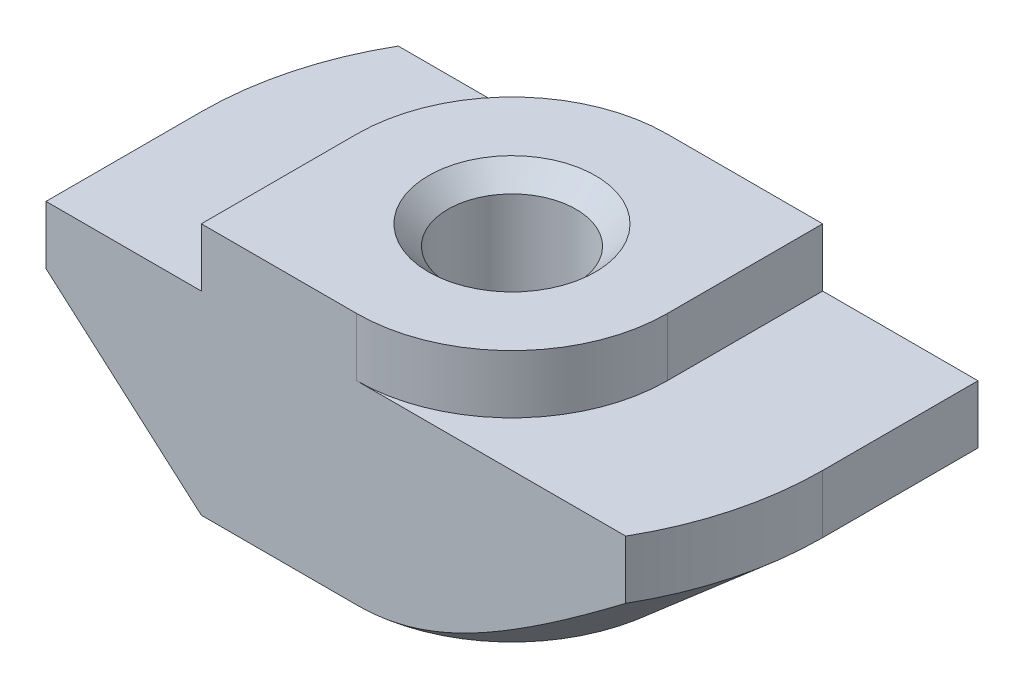
ISO-10303-21;
HEADER;
FILE_DESCRIPTION(('STEP AP214'),'2;1');
FILE_NAME('part.step','',(''),(''),'','','');
FILE_SCHEMA(('AUTOMOTIVE_DESIGN { 1 0 10303 214 1 1 1 1 }'));
ENDSEC;
DATA;
#1=APPLICATION_CONTEXT('core data for automotive mechanical design processes');
#2=APPLICATION_PROTOCOL_DEFINITION('international standard','automotive_design',2000,#1);
#3=PRODUCT_CONTEXT('',#1,'mechanical');
#4=PRODUCT('Part','Part','',(#3));
#5=PRODUCT_RELATED_PRODUCT_CATEGORY('part','',(#4));
#6=PRODUCT_DEFINITION_FORMATION('','',#4);
#7=PRODUCT_DEFINITION_CONTEXT('part definition',#1,'design');
#8=PRODUCT_DEFINITION('design','',#6,#7);
#9=PRODUCT_DEFINITION_SHAPE('','',#8);
#10=(LENGTH_UNIT() NAMED_UNIT(*) SI_UNIT(.MILLI.,.METRE.));
#11=(NAMED_UNIT(*) PLANE_ANGLE_UNIT() SI_UNIT($,.RADIAN.));
#12=(NAMED_UNIT(*) SI_UNIT($,.STERADIAN.) SOLID_ANGLE_UNIT());
#13=UNCERTAINTY_MEASURE_WITH_UNIT(LENGTH_MEASURE(1.E-05),#10,'distance_accuracy_value','');
#14=(GEOMETRIC_REPRESENTATION_CONTEXT(3) GLOBAL_UNCERTAINTY_ASSIGNED_CONTEXT((#13)) GLOBAL_UNIT_ASSIGNED_CONTEXT((#10,
#11,#12)) REPRESENTATION_CONTEXT('',''));
#15=CARTESIAN_POINT('',(0.,0.,0.));
#16=DIRECTION('',(0.,0.,1.));
#17=DIRECTION('',(1.,0.,0.));
#18=AXIS2_PLACEMENT_3D('',#15,#16,#17);
#19=CARTESIAN_POINT('',(-8.,-1.5,4.));
#20=DIRECTION('',(1.,0.,0.));
#21=DIRECTION('',(0.,0.,-1.));
#22=AXIS2_PLACEMENT_3D('',#19,#20,#21);
#23=PLANE('',#22);
#24=DIRECTION('',(0.,0.,-1.));
#25=VECTOR('',#24,1.);
#26=CARTESIAN_POINT('',(-8.,-3.,4.));
#27=LINE('',#26,#25);
#28=CARTESIAN_POINT('',(-8.,-3.,4.));
#29=VERTEX_POINT('',#28);
#30=CARTESIAN_POINT('',(-8.,-3.,0.));
#31=VERTEX_POINT('',#30);
#32=EDGE_CURVE('E316',#29,#31,#27,.T.);
#33=ORIENTED_EDGE('',*,*,#32,.F.);
#34=DIRECTION('',(0.,-1.,0.));
#35=VECTOR('',#34,1.);
#36=CARTESIAN_POINT('',(-8.,-1.5,4.));
#37=LINE('',#36,#35);
#38=CARTESIAN_POINT('',(-8.,-1.5,4.));
#39=VERTEX_POINT('',#38);
#40=EDGE_CURVE('E162',#39,#29,#37,.T.);
#41=ORIENTED_EDGE('',*,*,#40,.F.);
#42=DIRECTION('',(0.,0.,-1.));
#43=VECTOR('',#42,1.);
#44=CARTESIAN_POINT('',(-8.,-1.5,4.));
#45=LINE('',#44,#43);
#46=CARTESIAN_POINT('',(-8.,-1.5,0.));
#47=VERTEX_POINT('',#46);
#48=EDGE_CURVE('E44',#39,#47,#45,.T.);
#49=ORIENTED_EDGE('',*,*,#48,.T.);
#50=DIRECTION('',(0.,1.,0.));
#51=VECTOR('',#50,1.);
#52=CARTESIAN_POINT('',(-8.,-6.5,0.));
#53=LINE('',#52,#51);
#54=EDGE_CURVE('E208',#31,#47,#53,.T.);
#55=ORIENTED_EDGE('',*,*,#54,.F.);
#56=EDGE_LOOP('',(#33,#41,#49,#55));
#57=FACE_BOUND('',#56,.T.);
#58=ADVANCED_FACE('F36',(#57),#23,.F.);
#59=CARTESIAN_POINT('',(-8.,-6.5,4.));
#60=DIRECTION('',(0.,1.,0.));
#61=DIRECTION('',(0.,0.,1.));
#62=AXIS2_PLACEMENT_3D('',#59,#60,#61);
#63=PLANE('',#62);
#64=CARTESIAN_POINT('',(0.,-6.5,0.));
#65=DIRECTION('',(0.,1.,0.));
#66=DIRECTION('',(0.,0.,1.));
#67=AXIS2_PLACEMENT_3D('',#64,#65,#66);
#68=CIRCLE('',#67,2.15);
#69=CARTESIAN_POINT('',(0.,-6.5,2.15));
#70=VERTEX_POINT('',#69);
#71=EDGE_CURVE('E257',#70,#70,#68,.T.);
#72=ORIENTED_EDGE('',*,*,#71,.T.);
#73=EDGE_LOOP('',(#72));
#74=FACE_BOUND('',#73,.T.);
#75=DIRECTION('',(1.,0.,0.));
#76=VECTOR('',#75,1.);
#77=CARTESIAN_POINT('',(-8.,-6.5,4.));
#78=LINE('',#77,#76);
#79=CARTESIAN_POINT('',(-4.,-6.5,4.));
#80=VERTEX_POINT('',#79);
#81=CARTESIAN_POINT('',(0.,-6.5,4.));
#82=VERTEX_POINT('',#81);
#83=EDGE_CURVE('E160',#80,#82,#78,.T.);
#84=ORIENTED_EDGE('',*,*,#83,.F.);
#85=DIRECTION('',(0.,0.,-1.));
#86=VECTOR('',#85,1.);
#87=CARTESIAN_POINT('',(-4.,-6.5,4.));
#88=LINE('',#87,#86);
#89=CARTESIAN_POINT('',(-4.,-6.5,0.));
#90=VERTEX_POINT('',#89);
#91=EDGE_CURVE('E145',#80,#90,#88,.T.);
#92=ORIENTED_EDGE('',*,*,#91,.T.);
#93=CARTESIAN_POINT('',(0.,-6.5,0.));
#94=DIRECTION('',(0.,-1.,0.));
#95=DIRECTION('',(-1.,0.,0.));
#96=AXIS2_PLACEMENT_3D('',#93,#94,#95);
#97=CIRCLE('',#96,4.);
#98=CARTESIAN_POINT('',(0.,-6.5,-4.));
#99=VERTEX_POINT('',#98);
#100=EDGE_CURVE('E317',#90,#99,#97,.T.);
#101=ORIENTED_EDGE('',*,*,#100,.T.);
#102=DIRECTION('',(1.,0.,0.));
#103=VECTOR('',#102,1.);
#104=CARTESIAN_POINT('',(-8.,-6.5,-4.));
#105=LINE('',#104,#103);
#106=CARTESIAN_POINT('',(4.,-6.5,-4.));
#107=VERTEX_POINT('',#106);
#108=EDGE_CURVE('E180',#99,#107,#105,.T.);
#109=ORIENTED_EDGE('',*,*,#108,.T.);
#110=DIRECTION('',(0.,0.,1.));
#111=VECTOR('',#110,1.);
#112=CARTESIAN_POINT('',(4.,-6.5,-8.));
#113=LINE('',#112,#111);
#114=CARTESIAN_POINT('',(4.,-6.5,0.));
#115=VERTEX_POINT('',#114);
#116=EDGE_CURVE('E51',#107,#115,#113,.T.);
#117=ORIENTED_EDGE('',*,*,#116,.T.);
#118=CARTESIAN_POINT('',(0.,-6.5,0.));
#119=DIRECTION('',(0.,-1.,0.));
#120=DIRECTION('',(1.,0.,0.));
#121=AXIS2_PLACEMENT_3D('',#118,#119,#120);
#122=CIRCLE('',#121,4.);
#123=EDGE_CURVE('E166',#115,#82,#122,.T.);
#124=ORIENTED_EDGE('',*,*,#123,.T.);
#125=EDGE_LOOP('',(#84,#92,#101,#109,#117,#124));
#126=FACE_BOUND('',#125,.T.);
#127=ADVANCED_FACE('F165',(#74,#126),#63,.F.);
#128=CARTESIAN_POINT('',(8.,-1.5,4.));
#129=DIRECTION('',(-1.,0.,0.));
#130=DIRECTION('',(0.,0.,1.));
#131=AXIS2_PLACEMENT_3D('',#128,#129,#130);
#132=PLANE('',#131);
#133=DIRECTION('',(0.,0.,1.));
#134=VECTOR('',#133,1.);
#135=CARTESIAN_POINT('',(8.,-3.,-8.));
#136=LINE('',#135,#134);
#137=CARTESIAN_POINT('',(8.,-3.,-4.));
#138=VERTEX_POINT('',#137);
#139=CARTESIAN_POINT('',(8.,-3.,0.));
#140=VERTEX_POINT('',#139);
#141=EDGE_CURVE('E304',#138,#140,#136,.T.);
#142=ORIENTED_EDGE('',*,*,#141,.F.);
#143=DIRECTION('',(0.,1.,0.));
#144=VECTOR('',#143,1.);
#145=CARTESIAN_POINT('',(8.,-1.5,-4.));
#146=LINE('',#145,#144);
#147=CARTESIAN_POINT('',(8.,-1.5,-4.));
#148=VERTEX_POINT('',#147);
#149=EDGE_CURVE('E184',#138,#148,#146,.T.);
#150=ORIENTED_EDGE('',*,*,#149,.T.);
#151=DIRECTION('',(0.,0.,-1.));
#152=VECTOR('',#151,1.);
#153=CARTESIAN_POINT('',(8.,-1.5,4.));
#154=LINE('',#153,#152);
#155=CARTESIAN_POINT('',(8.,-1.5,0.));
#156=VERTEX_POINT('',#155);
#157=EDGE_CURVE('E202',#156,#148,#154,.T.);
#158=ORIENTED_EDGE('',*,*,#157,.F.);
#159=DIRECTION('',(0.,1.,0.));
#160=VECTOR('',#159,1.);
#161=CARTESIAN_POINT('',(8.,-6.5,0.));
#162=LINE('',#161,#160);
#163=EDGE_CURVE('E219',#140,#156,#162,.T.);
#164=ORIENTED_EDGE('',*,*,#163,.F.);
#165=EDGE_LOOP('',(#142,#150,#158,#164));
#166=FACE_BOUND('',#165,.T.);
#167=ADVANCED_FACE('F303',(#166),#132,.F.);
#168=CARTESIAN_POINT('',(0.,0.,4.));
#169=DIRECTION('',(0.,0.,-1.));
#170=DIRECTION('',(-1.,0.,0.));
#171=AXIS2_PLACEMENT_3D('',#168,#169,#170);
#172=PLANE('',#171);
#173=DIRECTION('',(-0.752576694706878,0.658504607868518,0.));
#174=VECTOR('',#173,1.);
#175=CARTESIAN_POINT('',(-4.,-6.5,4.));
#176=LINE('',#175,#174);
#177=EDGE_CURVE('E148',#80,#29,#176,.T.);
#178=ORIENTED_EDGE('',*,*,#177,.F.);
#179=ORIENTED_EDGE('',*,*,#83,.T.);
#180=CARTESIAN_POINT('',(14.6904905784055,3.32215914737832,4.));
#181=CARTESIAN_POINT('',(14.3847340887088,3.06403182750837,4.));
#182=CARTESIAN_POINT('',(14.0787139356754,2.80621594721695,4.));
#183=CARTESIAN_POINT('',(13.4660102927614,2.29136853816874,4.));
#184=CARTESIAN_POINT('',(13.1593267973511,2.03433701599371,4.));
#185=CARTESIAN_POINT('',(12.5450720332835,1.52114597216813,4.));
#186=CARTESIAN_POINT('',(12.2375005226594,1.26498673998448,4.));
#187=CARTESIAN_POINT('',(11.621379785589,0.753848346635908,4.));
#188=CARTESIAN_POINT('',(11.3128305625947,0.498869181312189,4.));
#189=CARTESIAN_POINT('',(10.7002145011881,-0.00491682645367106,4.));
#190=CARTESIAN_POINT('',(10.3961699625989,-0.253750767290044,4.));
#191=CARTESIAN_POINT('',(9.78659827767615,-0.749595514973884,4.));
#192=CARTESIAN_POINT('',(9.48107113722175,-0.996606329041067,4.));
#193=CARTESIAN_POINT('',(8.86814910234505,-1.48822154847088,4.));
#194=CARTESIAN_POINT('',(8.56075445261905,-1.7328262585509,4.));
#195=CARTESIAN_POINT('',(7.94347197423434,-2.21886531838598,4.));
#196=CARTESIAN_POINT('',(7.63358419509566,-2.46029973086189,4.));
#197=CARTESIAN_POINT('',(7.08115132126321,-2.88450105938665,4.));
#198=CARTESIAN_POINT('',(6.83928285358191,-3.06814795081988,4.));
#199=CARTESIAN_POINT('',(6.35294664237881,-3.43201927580775,4.));
#200=CARTESIAN_POINT('',(6.10847869152532,-3.61224343312641,4.));
#201=CARTESIAN_POINT('',(5.61348157153568,-3.97001904061898,4.));
#202=CARTESIAN_POINT('',(5.36291531280204,-4.14751931475903,4.));
#203=CARTESIAN_POINT('',(4.85727365006101,-4.49592911962344,4.));
#204=CARTESIAN_POINT('',(4.60219916319015,-4.66683996887094,4.));
#205=CARTESIAN_POINT('',(4.2130071322017,-4.91734041501033,4.));
#206=CARTESIAN_POINT('',(4.08116535064602,-5.00046374434322,4.));
#207=CARTESIAN_POINT('',(3.81562875478638,-5.16368942812443,4.));
#208=CARTESIAN_POINT('',(3.68193405117562,-5.24379196197976,4.));
#209=CARTESIAN_POINT('',(3.41220147814096,-5.40038499680941,4.));
#210=CARTESIAN_POINT('',(3.27616075326498,-5.47687059912128,4.));
#211=CARTESIAN_POINT('',(3.00156225820197,-5.62520082854102,4.));
#212=CARTESIAN_POINT('',(2.86300454546661,-5.69704556140923,4.));
#213=CARTESIAN_POINT('',(2.5849954677744,-5.83393518990307,4.));
#214=CARTESIAN_POINT('',(2.44558485527697,-5.89906227835382,4.));
#215=CARTESIAN_POINT('',(2.16361562976938,-6.02223140662004,4.));
#216=CARTESIAN_POINT('',(2.02105656760955,-6.08027242774449,4.));
#217=CARTESIAN_POINT('',(1.7329549007792,-6.18735094349871,4.));
#218=CARTESIAN_POINT('',(1.58742049089665,-6.2364102179662,4.));
#219=CARTESIAN_POINT('',(1.29316207972955,-6.32363216278026,4.));
#220=CARTESIAN_POINT('',(1.1444398948231,-6.36180086992272,4.));
#221=CARTESIAN_POINT('',(0.839100640998917,-6.42624492204711,4.));
#222=CARTESIAN_POINT('',(0.682386957719906,-6.45207249805466,4.));
#223=CARTESIAN_POINT('',(0.367144369417336,-6.48794533602483,4.));
#224=CARTESIAN_POINT('',(0.208615728897641,-6.49799286893765,4.));
#225=CARTESIAN_POINT('',(-0.108539722018433,-6.50145944673209,4.));
#226=CARTESIAN_POINT('',(-0.267166425139258,-6.49488795542754,4.));
#227=CARTESIAN_POINT('',(-0.582932728201337,-6.46570204746688,4.));
#228=CARTESIAN_POINT('',(-0.740071943547874,-6.44308359075197,4.));
#229=CARTESIAN_POINT('',(-1.09152696533888,-6.37587755691426,4.));
#230=CARTESIAN_POINT('',(-1.28504118066978,-6.32714329543957,4.));
#231=CARTESIAN_POINT('',(-1.66656634751073,-6.21161586114347,4.));
#232=CARTESIAN_POINT('',(-1.85457361936942,-6.14481090567952,4.));
#233=CARTESIAN_POINT('',(-2.22785278502951,-5.99643229439673,4.));
#234=CARTESIAN_POINT('',(-2.41304095011,-5.91465153583585,4.));
#235=CARTESIAN_POINT('',(-2.77832077795005,-5.74066303773618,4.));
#236=CARTESIAN_POINT('',(-2.95841376958414,-5.64845804888058,4.));
#237=CARTESIAN_POINT('',(-3.34961919306917,-5.43725005686976,4.));
#238=CARTESIAN_POINT('',(-3.55981165080308,-5.31655620274668,4.));
#239=CARTESIAN_POINT('',(-3.97543991863338,-5.06719713259556,4.));
#240=CARTESIAN_POINT('',(-4.18087442666426,-4.93852976912504,4.));
#241=CARTESIAN_POINT('',(-4.5882400284195,-4.67520296890076,4.));
#242=CARTESIAN_POINT('',(-4.79016601988849,-4.54053567979022,4.));
#243=CARTESIAN_POINT('',(-5.19103912814155,-4.26683396442206,4.));
#244=CARTESIAN_POINT('',(-5.38998608598997,-4.12779930637635,4.));
#245=CARTESIAN_POINT('',(-5.7725203673202,-3.8556281179886,4.));
#246=CARTESIAN_POINT('',(-5.95625882060498,-3.72270335637143,4.));
#247=CARTESIAN_POINT('',(-6.32204531106766,-3.45453802790882,4.));
#248=CARTESIAN_POINT('',(-6.50409328688208,-3.31929737750067,4.));
#249=CARTESIAN_POINT('',(-6.86616256077309,-3.04743487184612,4.));
#250=CARTESIAN_POINT('',(-7.04618870734579,-2.91081946202426,4.));
#251=CARTESIAN_POINT('',(-7.4050622812191,-2.63608068651936,4.));
#252=CARTESIAN_POINT('',(-7.58390981061062,-2.49795745427084,4.));
#253=CARTESIAN_POINT('',(-7.76228734813001,-2.35923541653878,4.));
#254=B_SPLINE_CURVE_WITH_KNOTS('',3,(#180,#181,#182,#183,#184,#185,#186,#187,#188,#189,#190,
#191,#192,#193,#194,#195,#196,#197,#198,#199,#200,#201,#202,#203,#204,#205,#206,#207,#208,#209,
#210,#211,#212,#213,#214,#215,#216,#217,#218,#219,#220,#221,#222,#223,#224,#225,#226,#227,#228,
#229,#230,#231,#232,#233,#234,#235,#236,#237,#238,#239,#240,#241,#242,#243,#244,#245,#246,#247,
#248,#249,#250,#251,#252,#253),.UNSPECIFIED.,.F.,.F.,(4,2,2,2,2,2,2,2,2,2,2,2,2,2,2,2,2,2,2,2,2,
2,2,2,2,2,2,2,2,2,2,2,2,2,2,2,4),(0.,1.20043834755379,2.40088674077275,3.60170079974658,
4.8025106235708,5.98117091859529,7.15982654353094,8.33833092623221,9.51681195828205,
10.4278547957749,11.3389708502966,12.2601049438173,13.1810537544666,13.6485968730272,
14.1161121800276,14.5842435321965,15.052364212398,15.5138255838833,15.975353217003,
16.4357464236847,16.8958839298801,17.3716429767656,17.8473335495587,18.3227532981969,
18.798292783222,19.3957954910143,19.9936887317903,20.6005786392438,21.2073087763798,
21.9341934237486,22.6612746952789,23.3893372114805,24.1174384334345,24.7977544137816,
25.4780949934672,26.1560676910982,26.8339808703156),.UNSPECIFIED.);
#255=CARTESIAN_POINT('',(6.92820323027551,-3.,4.));
#256=VERTEX_POINT('',#255);
#257=EDGE_CURVE('E321',#256,#82,#254,.T.);
#258=ORIENTED_EDGE('',*,*,#257,.F.);
#259=DIRECTION('',(0.,1.,0.));
#260=VECTOR('',#259,1.);
#261=CARTESIAN_POINT('',(6.92820323027551,-6.5,4.));
#262=LINE('',#261,#260);
#263=CARTESIAN_POINT('',(6.92820323027551,-1.5,4.));
#264=VERTEX_POINT('',#263);
#265=EDGE_CURVE('E222',#256,#264,#262,.T.);
#266=ORIENTED_EDGE('',*,*,#265,.T.);
#267=DIRECTION('',(-1.,0.,0.));
#268=VECTOR('',#267,1.);
#269=CARTESIAN_POINT('',(4.,-1.5,4.));
#270=LINE('',#269,#268);
#271=CARTESIAN_POINT('',(0.,-1.5,4.));
#272=VERTEX_POINT('',#271);
#273=EDGE_CURVE('E167',#264,#272,#270,.T.);
#274=ORIENTED_EDGE('',*,*,#273,.T.);
#275=DIRECTION('',(0.,1.,0.));
#276=VECTOR('',#275,1.);
#277=CARTESIAN_POINT('',(0.,-7.15685424949238,4.));
#278=LINE('',#277,#276);
#279=CARTESIAN_POINT('',(0.,0.,4.));
#280=VERTEX_POINT('',#279);
#281=EDGE_CURVE('E245',#272,#280,#278,.T.);
#282=ORIENTED_EDGE('',*,*,#281,.T.);
#283=DIRECTION('',(-1.,0.,0.));
#284=VECTOR('',#283,1.);
#285=CARTESIAN_POINT('',(4.,0.,4.));
#286=LINE('',#285,#284);
#287=CARTESIAN_POINT('',(-4.,0.,4.));
#288=VERTEX_POINT('',#287);
#289=EDGE_CURVE('E169',#280,#288,#286,.T.);
#290=ORIENTED_EDGE('',*,*,#289,.T.);
#291=DIRECTION('',(0.,-1.,0.));
#292=VECTOR('',#291,1.);
#293=CARTESIAN_POINT('',(-4.,0.,4.));
#294=LINE('',#293,#292);
#295=CARTESIAN_POINT('',(-4.,-1.5,4.));
#296=VERTEX_POINT('',#295);
#297=EDGE_CURVE('E195',#288,#296,#294,.T.);
#298=ORIENTED_EDGE('',*,*,#297,.T.);
#299=DIRECTION('',(-1.,0.,0.));
#300=VECTOR('',#299,1.);
#301=CARTESIAN_POINT('',(-4.,-1.5,4.));
#302=LINE('',#301,#300);
#303=EDGE_CURVE('E171',#296,#39,#302,.T.);
#304=ORIENTED_EDGE('',*,*,#303,.T.);
#305=ORIENTED_EDGE('',*,*,#40,.T.);
#306=EDGE_LOOP('',(#178,#179,#258,#266,#274,#282,#290,#298,#304,#305));
#307=FACE_BOUND('',#306,.T.);
#308=ADVANCED_FACE('F158',(#307),#172,.F.);
#309=CARTESIAN_POINT('',(0.,0.,-4.));
#310=DIRECTION('',(0.,0.,-1.));
#311=DIRECTION('',(-1.,0.,0.));
#312=AXIS2_PLACEMENT_3D('',#309,#310,#311);
#313=PLANE('',#312);
#314=ORIENTED_EDGE('',*,*,#108,.F.);
#315=CARTESIAN_POINT('',(7.76228734813001,-2.35923541653878,-4.));
#316=CARTESIAN_POINT('',(7.63797879352638,-2.45592015293055,-4.));
#317=CARTESIAN_POINT('',(7.51343705696513,-2.55230486304676,-4.));
#318=CARTESIAN_POINT('',(7.26381762684636,-2.74438155235194,-4.));
#319=CARTESIAN_POINT('',(7.13873992508832,-2.84007352088096,-4.));
#320=CARTESIAN_POINT('',(6.76245796143779,-3.12607801429787,-4.));
#321=CARTESIAN_POINT('',(6.51034969039623,-3.3152061228012,-4.));
#322=CARTESIAN_POINT('',(5.99410259404109,-3.69579382335301,-4.));
#323=CARTESIAN_POINT('',(5.72985208763481,-3.88710225926351,-4.));
#324=CARTESIAN_POINT('',(5.19695761667315,-4.26334385378289,-4.));
#325=CARTESIAN_POINT('',(4.92831530480901,-4.44827933273934,-4.));
#326=CARTESIAN_POINT('',(4.52051944159743,-4.71893396527764,-4.));
#327=CARTESIAN_POINT('',(4.38365763859022,-4.80810405751299,-4.));
#328=CARTESIAN_POINT('',(4.10812140998681,-4.98359259792687,-4.));
#329=CARTESIAN_POINT('',(3.96944707174393,-5.06991118282885,-4.));
#330=CARTESIAN_POINT('',(3.68976495223787,-5.23915159478084,-4.));
#331=CARTESIAN_POINT('',(3.5487541633338,-5.32206847356048,-4.));
#332=CARTESIAN_POINT('',(3.26422692934428,-5.48348784331378,-4.));
#333=CARTESIAN_POINT('',(3.12071056146737,-5.56199046999753,-4.));
#334=CARTESIAN_POINT('',(2.83282374140378,-5.71234353123719,-4.));
#335=CARTESIAN_POINT('',(2.68849544072785,-5.78427356099484,-4.));
#336=CARTESIAN_POINT('',(2.39663673815625,-5.92127244284365,-4.));
#337=CARTESIAN_POINT('',(2.24910576947912,-5.98634006834896,-4.));
#338=CARTESIAN_POINT('',(1.80183158618905,-6.16822752509159,-4.));
#339=CARTESIAN_POINT('',(1.49640789539285,-6.27228099552519,-4.));
#340=CARTESIAN_POINT('',(1.05233061563864,-6.38260096239082,-4.));
#341=CARTESIAN_POINT('',(0.919027463250036,-6.41066102119685,-4.));
#342=CARTESIAN_POINT('',(0.650539921788468,-6.45588615630252,-4.));
#343=CARTESIAN_POINT('',(0.51535553964587,-6.47305127272778,-4.));
#344=CARTESIAN_POINT('',(0.244416454871644,-6.49545105484671,-4.));
#345=CARTESIAN_POINT('',(0.108664879322551,-6.50072304133224,-4.));
#346=CARTESIAN_POINT('',(-0.162768146645618,-6.49911688124239,-4.));
#347=CARTESIAN_POINT('',(-0.298449596114371,-6.49223857411636,-4.));
#348=CARTESIAN_POINT('',(-0.568122439673079,-6.46681378287136,-4.));
#349=CARTESIAN_POINT('',(-0.70211852516428,-6.44831614238918,-4.));
#350=CARTESIAN_POINT('',(-0.968201604754999,-6.40073495061865,-4.));
#351=CARTESIAN_POINT('',(-1.1002884026748,-6.37165031944127,-4.));
#352=CARTESIAN_POINT('',(-1.36269157636567,-6.30410993308005,-4.));
#353=CARTESIAN_POINT('',(-1.49299633565771,-6.2656096419317,-4.));
#354=CARTESIAN_POINT('',(-1.75097360755362,-6.18078638919448,-4.));
#355=CARTESIAN_POINT('',(-1.87864668497093,-6.13446512618272,-4.));
#356=CARTESIAN_POINT('',(-2.13650460655844,-6.03336012265943,-4.));
#357=CARTESIAN_POINT('',(-2.26658470397074,-5.97831141807566,-4.));
#358=CARTESIAN_POINT('',(-2.52419349397128,-5.86250450113516,-4.));
#359=CARTESIAN_POINT('',(-2.65172159663741,-5.80174498673762,-4.));
#360=CARTESIAN_POINT('',(-2.90458369699372,-5.67553363858828,-4.));
#361=CARTESIAN_POINT('',(-3.02991533088425,-5.61007709467075,-4.));
#362=CARTESIAN_POINT('',(-3.27853105159641,-5.47537344560646,-4.));
#363=CARTESIAN_POINT('',(-3.40181492074635,-5.40612594080969,-4.));
#364=CARTESIAN_POINT('',(-3.76995033555259,-5.19320165032188,-4.));
#365=CARTESIAN_POINT('',(-4.01209636597666,-5.04485051553612,-4.));
#366=CARTESIAN_POINT('',(-4.49079845178234,-4.73976449809493,-4.));
#367=CARTESIAN_POINT('',(-4.72735731704249,-4.58303396484722,-4.));
#368=CARTESIAN_POINT('',(-5.1995516100822,-4.26136742283763,-4.));
#369=CARTESIAN_POINT('',(-5.43513045316699,-4.09634866312507,-4.));
#370=CARTESIAN_POINT('',(-5.90307692458374,-3.76178653159456,-4.));
#371=CARTESIAN_POINT('',(-6.13544419976837,-3.59224266810594,-4.));
#372=CARTESIAN_POINT('',(-6.59710196595735,-3.25019721114037,-4.));
#373=CARTESIAN_POINT('',(-6.82639861262667,-3.07770390591183,-4.));
#374=CARTESIAN_POINT('',(-7.28302678091005,-2.73013366535019,-4.));
#375=CARTESIAN_POINT('',(-7.51035827230303,-2.55505669039589,-4.));
#376=CARTESIAN_POINT('',(-8.03783315756055,-2.14507175665098,-4.));
#377=CARTESIAN_POINT('',(-8.3373766439722,-1.9093927266408,-4.));
#378=CARTESIAN_POINT('',(-8.93437099912731,-1.43539503283533,-4.));
#379=CARTESIAN_POINT('',(-9.23182183438345,-1.19707632695543,-4.));
#380=CARTESIAN_POINT('',(-9.82535128846929,-0.718219965327653,-4.));
#381=CARTESIAN_POINT('',(-10.1214285131884,-0.477680583301082,-4.));
#382=CARTESIAN_POINT('',(-10.7122981245554,0.00497082797734213,-4.));
#383=CARTESIAN_POINT('',(-11.0070905087482,0.247082860232109,-4.));
#384=CARTESIAN_POINT('',(-11.5854434366838,0.724142336197048,-4.));
#385=CARTESIAN_POINT('',(-11.8690391078616,0.959047220790179,-4.));
#386=CARTESIAN_POINT('',(-12.4354432527144,1.42980508271359,-4.));
#387=CARTESIAN_POINT('',(-12.7182517245472,1.66565806225948,-4.));
#388=CARTESIAN_POINT('',(-13.282944518856,2.13791575666086,-4.));
#389=CARTESIAN_POINT('',(-13.5648294691391,2.37431972115667,-4.));
#390=CARTESIAN_POINT('',(-14.128047944097,2.84778043170314,-4.));
#391=CARTESIAN_POINT('',(-14.4093814719245,3.08483717400299,-4.));
#392=CARTESIAN_POINT('',(-14.6904905784055,3.32215914737832,-4.));
#393=B_SPLINE_CURVE_WITH_KNOTS('',3,(#315,#316,#317,#318,#319,#320,#321,#322,#323,#324,#325,
#326,#327,#328,#329,#330,#331,#332,#333,#334,#335,#336,#337,#338,#339,#340,#341,#342,#343,#344,
#345,#346,#347,#348,#349,#350,#351,#352,#353,#354,#355,#356,#357,#358,#359,#360,#361,#362,#363,
#364,#365,#366,#367,#368,#369,#370,#371,#372,#373,#374,#375,#376,#377,#378,#379,#380,#381,#382,
#383,#384,#385,#386,#387,#388,#389,#390,#391,#392),.UNSPECIFIED.,.F.,.F.,(4,2,2,2,2,2,2,2,2,2,2,
2,2,2,2,2,2,2,2,2,2,2,2,2,2,2,2,2,2,2,2,2,2,2,2,2,2,2,4),(0.,0.472444676861442,
0.944896608343604,1.89035158415088,2.86899060339188,3.84726945941377,4.33728530856671,
4.8272776283419,5.31795911845949,5.8086255149935,6.29221715677115,6.7758950897278,
7.73984294601889,8.14815209258924,8.55645973536539,8.96348431070383,9.37051426439336,
9.77584455197681,10.1812161954516,10.5885436411454,10.9957827360295,11.4193610225933,
11.8430361185904,12.2671421774613,12.6912930327904,13.5429259149977,14.3941209613749,
15.25692369152,16.1198205533784,16.9805978250682,17.8413883107243,18.9847995557902,
20.1282290566799,21.2726382692414,22.4170496676496,23.5217921033681,24.6265371222737,
25.7302179249054,26.8338923990378),.UNSPECIFIED.);
#394=CARTESIAN_POINT('',(-6.92820323027551,-3.,-4.));
#395=VERTEX_POINT('',#394);
#396=EDGE_CURVE('E226',#99,#395,#393,.T.);
#397=ORIENTED_EDGE('',*,*,#396,.T.);
#398=DIRECTION('',(0.,1.,0.));
#399=VECTOR('',#398,1.);
#400=CARTESIAN_POINT('',(-6.92820323027551,-6.5,-4.));
#401=LINE('',#400,#399);
#402=CARTESIAN_POINT('',(-6.92820323027551,-1.5,-4.));
#403=VERTEX_POINT('',#402);
#404=EDGE_CURVE('E218',#395,#403,#401,.T.);
#405=ORIENTED_EDGE('',*,*,#404,.T.);
#406=DIRECTION('',(-1.,0.,0.));
#407=VECTOR('',#406,1.);
#408=CARTESIAN_POINT('',(-4.,-1.5,-4.));
#409=LINE('',#408,#407);
#410=CARTESIAN_POINT('',(0.,-1.5,-4.));
#411=VERTEX_POINT('',#410);
#412=EDGE_CURVE('E177',#411,#403,#409,.T.);
#413=ORIENTED_EDGE('',*,*,#412,.F.);
#414=DIRECTION('',(0.,1.,0.));
#415=VECTOR('',#414,1.);
#416=CARTESIAN_POINT('',(0.,-7.15685424949238,-4.));
#417=LINE('',#416,#415);
#418=CARTESIAN_POINT('',(0.,0.,-4.));
#419=VERTEX_POINT('',#418);
#420=EDGE_CURVE('E254',#411,#419,#417,.T.);
#421=ORIENTED_EDGE('',*,*,#420,.T.);
#422=DIRECTION('',(-1.,0.,0.));
#423=VECTOR('',#422,1.);
#424=CARTESIAN_POINT('',(4.,0.,-4.));
#425=LINE('',#424,#423);
#426=CARTESIAN_POINT('',(4.,0.,-4.));
#427=VERTEX_POINT('',#426);
#428=EDGE_CURVE('E192',#427,#419,#425,.T.);
#429=ORIENTED_EDGE('',*,*,#428,.F.);
#430=DIRECTION('',(0.,1.,0.));
#431=VECTOR('',#430,1.);
#432=CARTESIAN_POINT('',(4.,0.,-4.));
#433=LINE('',#432,#431);
#434=CARTESIAN_POINT('',(4.,-1.5,-4.));
#435=VERTEX_POINT('',#434);
#436=EDGE_CURVE('E189',#435,#427,#433,.T.);
#437=ORIENTED_EDGE('',*,*,#436,.F.);
#438=DIRECTION('',(-1.,0.,0.));
#439=VECTOR('',#438,1.);
#440=CARTESIAN_POINT('',(4.,-1.5,-4.));
#441=LINE('',#440,#439);
#442=EDGE_CURVE('E186',#148,#435,#441,.T.);
#443=ORIENTED_EDGE('',*,*,#442,.F.);
#444=ORIENTED_EDGE('',*,*,#149,.F.);
#445=DIRECTION('',(-0.752576694706878,-0.658504607868518,0.));
#446=VECTOR('',#445,1.);
#447=CARTESIAN_POINT('',(4.95575221238938,-5.66371681415929,-4.));
#448=LINE('',#447,#446);
#449=EDGE_CURVE('E313',#138,#107,#448,.T.);
#450=ORIENTED_EDGE('',*,*,#449,.T.);
#451=EDGE_LOOP('',(#314,#397,#405,#413,#421,#429,#437,#443,#444,#450));
#452=FACE_BOUND('',#451,.T.);
#453=ADVANCED_FACE('F282',(#452),#313,.T.);
#454=CARTESIAN_POINT('',(0.,-6.5,0.));
#455=DIRECTION('',(0.,1.,0.));
#456=DIRECTION('',(-1.,0.,0.));
#457=AXIS2_PLACEMENT_3D('',#454,#455,#456);
#458=CYLINDRICAL_SURFACE('',#457,8.);
#459=CARTESIAN_POINT('',(0.,-3.,0.));
#460=DIRECTION('',(0.,-1.,0.));
#461=DIRECTION('',(-1.,0.,0.));
#462=AXIS2_PLACEMENT_3D('',#459,#460,#461);
#463=CIRCLE('',#462,8.);
#464=EDGE_CURVE('E59',#31,#395,#463,.T.);
#465=ORIENTED_EDGE('',*,*,#464,.F.);
#466=ORIENTED_EDGE('',*,*,#54,.T.);
#467=CARTESIAN_POINT('',(0.,-1.5,0.));
#468=DIRECTION('',(0.,-1.,0.));
#469=DIRECTION('',(-1.,0.,0.));
#470=AXIS2_PLACEMENT_3D('',#467,#468,#469);
#471=CIRCLE('',#470,8.);
#472=EDGE_CURVE('E214',#47,#403,#471,.T.);
#473=ORIENTED_EDGE('',*,*,#472,.T.);
#474=ORIENTED_EDGE('',*,*,#404,.F.);
#475=EDGE_LOOP('',(#465,#466,#473,#474));
#476=FACE_BOUND('',#475,.T.);
#477=ADVANCED_FACE('F344',(#476),#458,.T.);
#478=CARTESIAN_POINT('',(0.,-6.5,0.));
#479=DIRECTION('',(0.,1.,0.));
#480=DIRECTION('',(-1.,0.,0.));
#481=AXIS2_PLACEMENT_3D('',#478,#479,#480);
#482=CYLINDRICAL_SURFACE('',#481,8.);
#483=CARTESIAN_POINT('',(0.,-3.,0.));
#484=DIRECTION('',(0.,-1.,0.));
#485=DIRECTION('',(1.,0.,0.));
#486=AXIS2_PLACEMENT_3D('',#483,#484,#485);
#487=CIRCLE('',#486,8.);
#488=EDGE_CURVE('E309',#140,#256,#487,.T.);
#489=ORIENTED_EDGE('',*,*,#488,.F.);
#490=ORIENTED_EDGE('',*,*,#163,.T.);
#491=CARTESIAN_POINT('',(0.,-1.5,0.));
#492=DIRECTION('',(0.,-1.,0.));
#493=DIRECTION('',(1.,0.,0.));
#494=AXIS2_PLACEMENT_3D('',#491,#492,#493);
#495=CIRCLE('',#494,8.);
#496=EDGE_CURVE('E236',#156,#264,#495,.T.);
#497=ORIENTED_EDGE('',*,*,#496,.T.);
#498=ORIENTED_EDGE('',*,*,#265,.F.);
#499=EDGE_LOOP('',(#489,#490,#497,#498));
#500=FACE_BOUND('',#499,.T.);
#501=ADVANCED_FACE('F347',(#500),#482,.T.);
#502=CARTESIAN_POINT('',(4.,0.,4.));
#503=DIRECTION('',(0.,-1.,0.));
#504=DIRECTION('',(0.,0.,-1.));
#505=AXIS2_PLACEMENT_3D('',#502,#503,#504);
#506=PLANE('',#505);
#507=ORIENTED_EDGE('',*,*,#289,.F.);
#508=CARTESIAN_POINT('',(0.,0.,0.));
#509=DIRECTION('',(0.,-1.,0.));
#510=DIRECTION('',(0.,0.,-1.));
#511=AXIS2_PLACEMENT_3D('',#508,#509,#510);
#512=CIRCLE('',#511,4.);
#513=CARTESIAN_POINT('',(4.,0.,0.));
#514=VERTEX_POINT('',#513);
#515=EDGE_CURVE('E234',#514,#280,#512,.T.);
#516=ORIENTED_EDGE('',*,*,#515,.F.);
#517=DIRECTION('',(0.,0.,-1.));
#518=VECTOR('',#517,1.);
#519=CARTESIAN_POINT('',(4.,0.,4.));
#520=LINE('',#519,#518);
#521=EDGE_CURVE('E198',#514,#427,#520,.T.);
#522=ORIENTED_EDGE('',*,*,#521,.T.);
#523=ORIENTED_EDGE('',*,*,#428,.T.);
#524=CARTESIAN_POINT('',(0.,0.,0.));
#525=DIRECTION('',(0.,-1.,0.));
#526=DIRECTION('',(0.,0.,-1.));
#527=AXIS2_PLACEMENT_3D('',#524,#525,#526);
#528=CIRCLE('',#527,4.);
#529=CARTESIAN_POINT('',(-4.,0.,0.));
#530=VERTEX_POINT('',#529);
#531=EDGE_CURVE('E249',#530,#419,#528,.T.);
#532=ORIENTED_EDGE('',*,*,#531,.F.);
#533=DIRECTION('',(0.,0.,-1.));
#534=VECTOR('',#533,1.);
#535=CARTESIAN_POINT('',(-4.,0.,4.));
#536=LINE('',#535,#534);
#537=EDGE_CURVE('E176',#288,#530,#536,.T.);
#538=ORIENTED_EDGE('',*,*,#537,.F.);
#539=EDGE_LOOP('',(#507,#516,#522,#523,#532,#538));
#540=FACE_BOUND('',#539,.T.);
#541=CARTESIAN_POINT('',(0.,0.,0.));
#542=DIRECTION('',(0.,1.,0.));
#543=DIRECTION('',(0.,0.,1.));
#544=AXIS2_PLACEMENT_3D('',#541,#542,#543);
#545=CIRCLE('',#544,2.15);
#546=CARTESIAN_POINT('',(0.,0.,2.15));
#547=VERTEX_POINT('',#546);
#548=EDGE_CURVE('E261',#547,#547,#545,.T.);
#549=ORIENTED_EDGE('',*,*,#548,.F.);
#550=EDGE_LOOP('',(#549));
#551=FACE_BOUND('',#550,.T.);
#552=ADVANCED_FACE('F285',(#540,#551),#506,.F.);
#553=CARTESIAN_POINT('',(-4.,0.,4.));
#554=DIRECTION('',(1.,0.,0.));
#555=DIRECTION('',(0.,0.,-1.));
#556=AXIS2_PLACEMENT_3D('',#553,#554,#555);
#557=PLANE('',#556);
#558=ORIENTED_EDGE('',*,*,#537,.T.);
#559=DIRECTION('',(0.,1.,0.));
#560=VECTOR('',#559,1.);
#561=CARTESIAN_POINT('',(-4.,-7.15685424949238,0.));
#562=LINE('',#561,#560);
#563=CARTESIAN_POINT('',(-4.,-1.5,0.));
#564=VERTEX_POINT('',#563);
#565=EDGE_CURVE('E251',#564,#530,#562,.T.);
#566=ORIENTED_EDGE('',*,*,#565,.F.);
#567=DIRECTION('',(0.,0.,-1.));
#568=VECTOR('',#567,1.);
#569=CARTESIAN_POINT('',(-4.,-1.5,4.));
#570=LINE('',#569,#568);
#571=EDGE_CURVE('E11',#296,#564,#570,.T.);
#572=ORIENTED_EDGE('',*,*,#571,.F.);
#573=ORIENTED_EDGE('',*,*,#297,.F.);
#574=EDGE_LOOP('',(#558,#566,#572,#573));
#575=FACE_BOUND('',#574,.T.);
#576=ADVANCED_FACE('F38',(#575),#557,.F.);
#577=CARTESIAN_POINT('',(-4.,-1.5,4.));
#578=DIRECTION('',(0.,-1.,0.));
#579=DIRECTION('',(1.,0.,0.));
#580=AXIS2_PLACEMENT_3D('',#577,#578,#579);
#581=PLANE('',#580);
#582=ORIENTED_EDGE('',*,*,#412,.T.);
#583=ORIENTED_EDGE('',*,*,#472,.F.);
#584=ORIENTED_EDGE('',*,*,#48,.F.);
#585=ORIENTED_EDGE('',*,*,#303,.F.);
#586=ORIENTED_EDGE('',*,*,#571,.T.);
#587=CARTESIAN_POINT('',(0.,-1.5,0.));
#588=DIRECTION('',(0.,-1.,0.));
#589=DIRECTION('',(1.,0.,0.));
#590=AXIS2_PLACEMENT_3D('',#587,#588,#589);
#591=CIRCLE('',#590,4.);
#592=EDGE_CURVE('E252',#564,#411,#591,.T.);
#593=ORIENTED_EDGE('',*,*,#592,.T.);
#594=EDGE_LOOP('',(#582,#583,#584,#585,#586,#593));
#595=FACE_BOUND('',#594,.T.);
#596=ADVANCED_FACE('F211',(#595),#581,.F.);
#597=CARTESIAN_POINT('',(4.,-1.5,4.));
#598=DIRECTION('',(0.,-1.,0.));
#599=DIRECTION('',(1.,0.,0.));
#600=AXIS2_PLACEMENT_3D('',#597,#598,#599);
#601=PLANE('',#600);
#602=ORIENTED_EDGE('',*,*,#273,.F.);
#603=ORIENTED_EDGE('',*,*,#496,.F.);
#604=ORIENTED_EDGE('',*,*,#157,.T.);
#605=ORIENTED_EDGE('',*,*,#442,.T.);
#606=DIRECTION('',(0.,0.,-1.));
#607=VECTOR('',#606,1.);
#608=CARTESIAN_POINT('',(4.,-1.5,4.));
#609=LINE('',#608,#607);
#610=CARTESIAN_POINT('',(4.,-1.5,0.));
#611=VERTEX_POINT('',#610);
#612=EDGE_CURVE('E200',#611,#435,#609,.T.);
#613=ORIENTED_EDGE('',*,*,#612,.F.);
#614=CARTESIAN_POINT('',(0.,-1.5,0.));
#615=DIRECTION('',(0.,-1.,0.));
#616=DIRECTION('',(1.,0.,0.));
#617=AXIS2_PLACEMENT_3D('',#614,#615,#616);
#618=CIRCLE('',#617,4.);
#619=EDGE_CURVE('E242',#611,#272,#618,.T.);
#620=ORIENTED_EDGE('',*,*,#619,.T.);
#621=EDGE_LOOP('',(#602,#603,#604,#605,#613,#620));
#622=FACE_BOUND('',#621,.T.);
#623=ADVANCED_FACE('F297',(#622),#601,.F.);
#624=CARTESIAN_POINT('',(4.,0.,4.));
#625=DIRECTION('',(-1.,0.,0.));
#626=DIRECTION('',(0.,0.,1.));
#627=AXIS2_PLACEMENT_3D('',#624,#625,#626);
#628=PLANE('',#627);
#629=ORIENTED_EDGE('',*,*,#521,.F.);
#630=DIRECTION('',(0.,1.,0.));
#631=VECTOR('',#630,1.);
#632=CARTESIAN_POINT('',(4.,-7.15685424949238,0.));
#633=LINE('',#632,#631);
#634=EDGE_CURVE('E241',#611,#514,#633,.T.);
#635=ORIENTED_EDGE('',*,*,#634,.F.);
#636=ORIENTED_EDGE('',*,*,#612,.T.);
#637=ORIENTED_EDGE('',*,*,#436,.T.);
#638=EDGE_LOOP('',(#629,#635,#636,#637));
#639=FACE_BOUND('',#638,.T.);
#640=ADVANCED_FACE('F291',(#639),#628,.F.);
#641=CARTESIAN_POINT('',(0.,-6.,0.));
#642=DIRECTION('',(0.,-1.,0.));
#643=DIRECTION('',(0.,0.,-1.));
#644=AXIS2_PLACEMENT_3D('',#641,#642,#643);
#645=CONICAL_SURFACE('',#644,1.65,0.785398163397449);
#646=ORIENTED_EDGE('',*,*,#71,.F.);
#647=EDGE_LOOP('',(#646));
#648=FACE_BOUND('',#647,.T.);
#649=CARTESIAN_POINT('',(0.,-6.,0.));
#650=DIRECTION('',(0.,1.,0.));
#651=DIRECTION('',(0.,0.,1.));
#652=AXIS2_PLACEMENT_3D('',#649,#650,#651);
#653=CIRCLE('',#652,1.65);
#654=CARTESIAN_POINT('',(0.,-6.,1.65));
#655=VERTEX_POINT('',#654);
#656=EDGE_CURVE('E181',#655,#655,#653,.T.);
#657=ORIENTED_EDGE('',*,*,#656,.T.);
#658=EDGE_LOOP('',(#657));
#659=FACE_BOUND('',#658,.T.);
#660=ADVANCED_FACE('F362',(#648,#659),#645,.F.);
#661=CARTESIAN_POINT('',(0.,0.,0.));
#662=DIRECTION('',(0.,1.,0.));
#663=DIRECTION('',(0.,0.,1.));
#664=AXIS2_PLACEMENT_3D('',#661,#662,#663);
#665=CYLINDRICAL_SURFACE('',#664,1.65);
#666=ORIENTED_EDGE('',*,*,#656,.F.);
#667=EDGE_LOOP('',(#666));
#668=FACE_BOUND('',#667,.T.);
#669=CARTESIAN_POINT('',(0.,-0.5,0.));
#670=DIRECTION('',(0.,1.,0.));
#671=DIRECTION('',(0.,0.,1.));
#672=AXIS2_PLACEMENT_3D('',#669,#670,#671);
#673=CIRCLE('',#672,1.65);
#674=CARTESIAN_POINT('',(0.,-0.5,1.65));
#675=VERTEX_POINT('',#674);
#676=EDGE_CURVE('E264',#675,#675,#673,.T.);
#677=ORIENTED_EDGE('',*,*,#676,.T.);
#678=EDGE_LOOP('',(#677));
#679=FACE_BOUND('',#678,.T.);
#680=ADVANCED_FACE('F359',(#668,#679),#665,.F.);
#681=CARTESIAN_POINT('',(0.,0.,0.));
#682=DIRECTION('',(0.,1.,0.));
#683=DIRECTION('',(0.,0.,1.));
#684=AXIS2_PLACEMENT_3D('',#681,#682,#683);
#685=CONICAL_SURFACE('',#684,2.15,0.785398163397449);
#686=ORIENTED_EDGE('',*,*,#676,.F.);
#687=EDGE_LOOP('',(#686));
#688=FACE_BOUND('',#687,.T.);
#689=ORIENTED_EDGE('',*,*,#548,.T.);
#690=EDGE_LOOP('',(#689));
#691=FACE_BOUND('',#690,.T.);
#692=ADVANCED_FACE('F356',(#688,#691),#685,.F.);
#693=CARTESIAN_POINT('',(0.,-7.15685424949238,0.));
#694=DIRECTION('',(0.,1.,0.));
#695=DIRECTION('',(0.,0.,1.));
#696=AXIS2_PLACEMENT_3D('',#693,#694,#695);
#697=CYLINDRICAL_SURFACE('',#696,4.);
#698=ORIENTED_EDGE('',*,*,#565,.T.);
#699=ORIENTED_EDGE('',*,*,#531,.T.);
#700=ORIENTED_EDGE('',*,*,#420,.F.);
#701=ORIENTED_EDGE('',*,*,#592,.F.);
#702=EDGE_LOOP('',(#698,#699,#700,#701));
#703=FACE_BOUND('',#702,.T.);
#704=ADVANCED_FACE('F277',(#703),#697,.T.);
#705=CARTESIAN_POINT('',(0.,-7.15685424949238,0.));
#706=DIRECTION('',(0.,1.,0.));
#707=DIRECTION('',(0.,0.,1.));
#708=AXIS2_PLACEMENT_3D('',#705,#706,#707);
#709=CYLINDRICAL_SURFACE('',#708,4.);
#710=ORIENTED_EDGE('',*,*,#634,.T.);
#711=ORIENTED_EDGE('',*,*,#515,.T.);
#712=ORIENTED_EDGE('',*,*,#281,.F.);
#713=ORIENTED_EDGE('',*,*,#619,.F.);
#714=EDGE_LOOP('',(#710,#711,#712,#713));
#715=FACE_BOUND('',#714,.T.);
#716=ADVANCED_FACE('F339',(#715),#709,.T.);
#717=CARTESIAN_POINT('',(4.,-6.5,-8.));
#718=DIRECTION('',(0.658504607868518,-0.752576694706878,0.));
#719=DIRECTION('',(0.752576694706878,0.658504607868518,0.));
#720=AXIS2_PLACEMENT_3D('',#717,#718,#719);
#721=PLANE('',#720);
#722=ORIENTED_EDGE('',*,*,#141,.T.);
#723=DIRECTION('',(0.752576694706878,0.658504607868518,0.));
#724=VECTOR('',#723,1.);
#725=CARTESIAN_POINT('',(4.,-6.5,0.));
#726=LINE('',#725,#724);
#727=EDGE_CURVE('E306',#115,#140,#726,.T.);
#728=ORIENTED_EDGE('',*,*,#727,.F.);
#729=ORIENTED_EDGE('',*,*,#116,.F.);
#730=ORIENTED_EDGE('',*,*,#449,.F.);
#731=EDGE_LOOP('',(#722,#728,#729,#730));
#732=FACE_BOUND('',#731,.T.);
#733=ADVANCED_FACE('F334',(#732),#721,.T.);
#734=CARTESIAN_POINT('',(0.,-6.5,0.));
#735=DIRECTION('',(0.,1.,0.));
#736=DIRECTION('',(0.,0.,1.));
#737=AXIS2_PLACEMENT_3D('',#734,#735,#736);
#738=CONICAL_SURFACE('',#737,4.,0.851966327173272);
#739=ORIENTED_EDGE('',*,*,#257,.T.);
#740=ORIENTED_EDGE('',*,*,#123,.F.);
#741=ORIENTED_EDGE('',*,*,#727,.T.);
#742=ORIENTED_EDGE('',*,*,#488,.T.);
#743=EDGE_LOOP('',(#739,#740,#741,#742));
#744=FACE_BOUND('',#743,.T.);
#745=ADVANCED_FACE('F330',(#744),#738,.T.);
#746=CARTESIAN_POINT('',(-4.,-6.5,4.));
#747=DIRECTION('',(-0.658504607868518,-0.752576694706878,0.));
#748=DIRECTION('',(0.752576694706878,-0.658504607868518,0.));
#749=AXIS2_PLACEMENT_3D('',#746,#747,#748);
#750=PLANE('',#749);
#751=ORIENTED_EDGE('',*,*,#32,.T.);
#752=DIRECTION('',(-0.752576694706878,0.658504607868518,0.));
#753=VECTOR('',#752,1.);
#754=CARTESIAN_POINT('',(-4.,-6.5,0.));
#755=LINE('',#754,#753);
#756=EDGE_CURVE('E150',#90,#31,#755,.T.);
#757=ORIENTED_EDGE('',*,*,#756,.F.);
#758=ORIENTED_EDGE('',*,*,#91,.F.);
#759=ORIENTED_EDGE('',*,*,#177,.T.);
#760=EDGE_LOOP('',(#751,#757,#758,#759));
#761=FACE_BOUND('',#760,.T.);
#762=ADVANCED_FACE('F147',(#761),#750,.T.);
#763=CARTESIAN_POINT('',(0.,-6.5,0.));
#764=DIRECTION('',(0.,1.,0.));
#765=DIRECTION('',(0.,0.,1.));
#766=AXIS2_PLACEMENT_3D('',#763,#764,#765);
#767=CONICAL_SURFACE('',#766,4.,0.851966327173272);
#768=ORIENTED_EDGE('',*,*,#100,.F.);
#769=ORIENTED_EDGE('',*,*,#756,.T.);
#770=ORIENTED_EDGE('',*,*,#464,.T.);
#771=ORIENTED_EDGE('',*,*,#396,.F.);
#772=EDGE_LOOP('',(#768,#769,#770,#771));
#773=FACE_BOUND('',#772,.T.);
#774=ADVANCED_FACE('F336',(#773),#767,.T.);
#775=CLOSED_SHELL('',(#58,#127,#167,#308,#453,#477,#501,#552,#576,#596,#623,#640,#660,#680,#692,
#704,#716,#733,#745,#762,#774));
#776=MANIFOLD_SOLID_BREP('B2',#775);
#777=ADVANCED_BREP_SHAPE_REPRESENTATION('',(#18,#776),#14);
#778=SHAPE_DEFINITION_REPRESENTATION(#9,#777);
ENDSEC;
END-ISO-10303-21;
